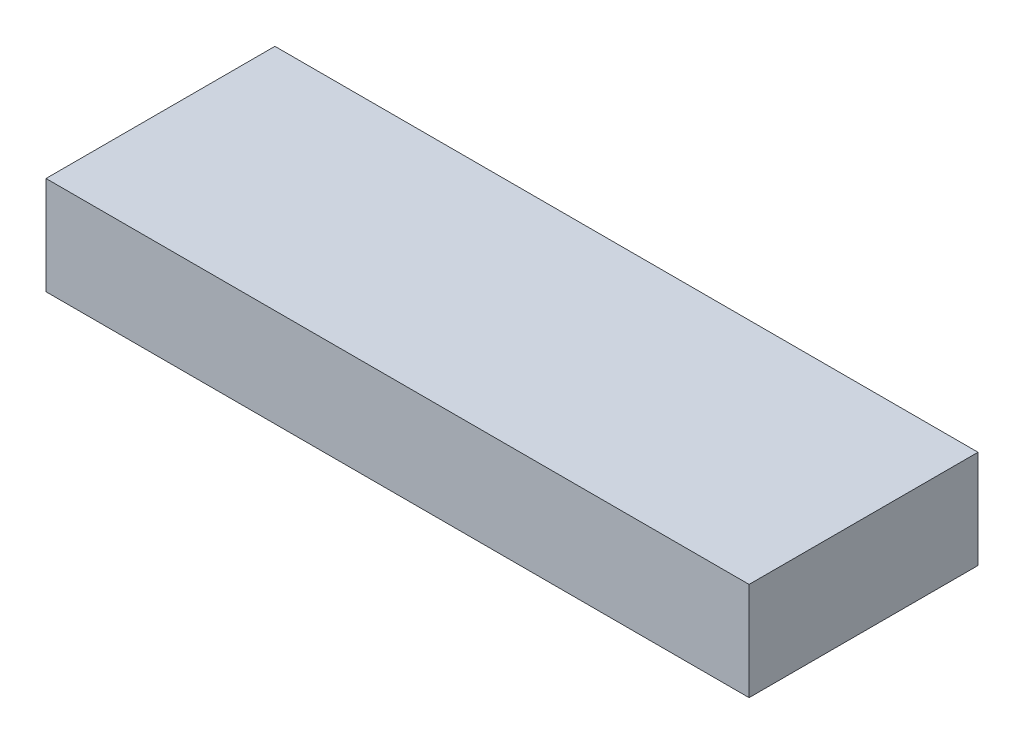
ISO-10303-21;
HEADER;
FILE_DESCRIPTION(('STEP AP214'),'2;1');
FILE_NAME('part.step','',(''),(''),'','','');
FILE_SCHEMA(('AUTOMOTIVE_DESIGN { 1 0 10303 214 1 1 1 1 }'));
ENDSEC;
DATA;
#1=APPLICATION_CONTEXT('core data for automotive mechanical design processes');
#2=APPLICATION_PROTOCOL_DEFINITION('international standard','automotive_design',2000,#1);
#3=PRODUCT_CONTEXT('',#1,'mechanical');
#4=PRODUCT('Part','Part','',(#3));
#5=PRODUCT_RELATED_PRODUCT_CATEGORY('part','',(#4));
#6=PRODUCT_DEFINITION_FORMATION('','',#4);
#7=PRODUCT_DEFINITION_CONTEXT('part definition',#1,'design');
#8=PRODUCT_DEFINITION('design','',#6,#7);
#9=PRODUCT_DEFINITION_SHAPE('','',#8);
#10=(LENGTH_UNIT() NAMED_UNIT(*) SI_UNIT(.MILLI.,.METRE.));
#11=(NAMED_UNIT(*) PLANE_ANGLE_UNIT() SI_UNIT($,.RADIAN.));
#12=(NAMED_UNIT(*) SI_UNIT($,.STERADIAN.) SOLID_ANGLE_UNIT());
#13=UNCERTAINTY_MEASURE_WITH_UNIT(LENGTH_MEASURE(1.E-05),#10,'distance_accuracy_value','');
#14=(GEOMETRIC_REPRESENTATION_CONTEXT(3) GLOBAL_UNCERTAINTY_ASSIGNED_CONTEXT((#13)) GLOBAL_UNIT_ASSIGNED_CONTEXT((#10,
#11,#12)) REPRESENTATION_CONTEXT('',''));
#15=CARTESIAN_POINT('',(0.,0.,0.));
#16=DIRECTION('',(0.,0.,1.));
#17=DIRECTION('',(1.,0.,0.));
#18=AXIS2_PLACEMENT_3D('',#15,#16,#17);
#19=CARTESIAN_POINT('',(0.,38.1,0.));
#20=DIRECTION('',(1.,0.,0.));
#21=DIRECTION('',(0.,0.,-1.));
#22=AXIS2_PLACEMENT_3D('',#19,#20,#21);
#23=PLANE('',#22);
#24=DIRECTION('',(0.,0.,1.));
#25=VECTOR('',#24,1.);
#26=CARTESIAN_POINT('',(0.,0.,0.));
#27=LINE('',#26,#25);
#28=CARTESIAN_POINT('',(0.,0.,0.));
#29=VERTEX_POINT('',#28);
#30=CARTESIAN_POINT('',(0.,0.,88.9));
#31=VERTEX_POINT('',#30);
#32=EDGE_CURVE('E96',#29,#31,#27,.T.);
#33=ORIENTED_EDGE('',*,*,#32,.T.);
#34=DIRECTION('',(0.,-1.,0.));
#35=VECTOR('',#34,1.);
#36=CARTESIAN_POINT('',(0.,38.1,88.9));
#37=LINE('',#36,#35);
#38=CARTESIAN_POINT('',(0.,38.1,88.9));
#39=VERTEX_POINT('',#38);
#40=EDGE_CURVE('E11',#39,#31,#37,.T.);
#41=ORIENTED_EDGE('',*,*,#40,.F.);
#42=DIRECTION('',(0.,0.,1.));
#43=VECTOR('',#42,1.);
#44=CARTESIAN_POINT('',(0.,38.1,0.));
#45=LINE('',#44,#43);
#46=CARTESIAN_POINT('',(0.,38.1,0.));
#47=VERTEX_POINT('',#46);
#48=EDGE_CURVE('E84',#47,#39,#45,.T.);
#49=ORIENTED_EDGE('',*,*,#48,.F.);
#50=DIRECTION('',(0.,-1.,0.));
#51=VECTOR('',#50,1.);
#52=CARTESIAN_POINT('',(0.,38.1,0.));
#53=LINE('',#52,#51);
#54=EDGE_CURVE('E92',#47,#29,#53,.T.);
#55=ORIENTED_EDGE('',*,*,#54,.T.);
#56=EDGE_LOOP('',(#33,#41,#49,#55));
#57=FACE_BOUND('',#56,.T.);
#58=ADVANCED_FACE('F33',(#57),#23,.F.);
#59=CARTESIAN_POINT('',(0.,38.1,88.9));
#60=DIRECTION('',(0.,0.,-1.));
#61=DIRECTION('',(-1.,0.,0.));
#62=AXIS2_PLACEMENT_3D('',#59,#60,#61);
#63=PLANE('',#62);
#64=DIRECTION('',(1.,0.,0.));
#65=VECTOR('',#64,1.);
#66=CARTESIAN_POINT('',(0.,0.,88.9));
#67=LINE('',#66,#65);
#68=CARTESIAN_POINT('',(273.05,0.,88.9));
#69=VERTEX_POINT('',#68);
#70=EDGE_CURVE('E88',#31,#69,#67,.T.);
#71=ORIENTED_EDGE('',*,*,#70,.T.);
#72=DIRECTION('',(0.,-1.,0.));
#73=VECTOR('',#72,1.);
#74=CARTESIAN_POINT('',(273.05,38.1,88.9));
#75=LINE('',#74,#73);
#76=CARTESIAN_POINT('',(273.05,38.1,88.9));
#77=VERTEX_POINT('',#76);
#78=EDGE_CURVE('E41',#77,#69,#75,.T.);
#79=ORIENTED_EDGE('',*,*,#78,.F.);
#80=DIRECTION('',(1.,0.,0.));
#81=VECTOR('',#80,1.);
#82=CARTESIAN_POINT('',(0.,38.1,88.9));
#83=LINE('',#82,#81);
#84=EDGE_CURVE('E79',#39,#77,#83,.T.);
#85=ORIENTED_EDGE('',*,*,#84,.F.);
#86=ORIENTED_EDGE('',*,*,#40,.T.);
#87=EDGE_LOOP('',(#71,#79,#85,#86));
#88=FACE_BOUND('',#87,.T.);
#89=ADVANCED_FACE('F87',(#88),#63,.F.);
#90=CARTESIAN_POINT('',(273.05,38.1,0.));
#91=DIRECTION('',(-1.,0.,0.));
#92=DIRECTION('',(0.,0.,1.));
#93=AXIS2_PLACEMENT_3D('',#90,#91,#92);
#94=PLANE('',#93);
#95=DIRECTION('',(0.,0.,-1.));
#96=VECTOR('',#95,1.);
#97=CARTESIAN_POINT('',(273.05,0.,0.));
#98=LINE('',#97,#96);
#99=CARTESIAN_POINT('',(273.05,0.,0.));
#100=VERTEX_POINT('',#99);
#101=EDGE_CURVE('E66',#69,#100,#98,.T.);
#102=ORIENTED_EDGE('',*,*,#101,.T.);
#103=DIRECTION('',(0.,-1.,0.));
#104=VECTOR('',#103,1.);
#105=CARTESIAN_POINT('',(273.05,38.1,0.));
#106=LINE('',#105,#104);
#107=CARTESIAN_POINT('',(273.05,38.1,0.));
#108=VERTEX_POINT('',#107);
#109=EDGE_CURVE('E89',#108,#100,#106,.T.);
#110=ORIENTED_EDGE('',*,*,#109,.F.);
#111=DIRECTION('',(0.,0.,-1.));
#112=VECTOR('',#111,1.);
#113=CARTESIAN_POINT('',(273.05,38.1,0.));
#114=LINE('',#113,#112);
#115=EDGE_CURVE('E82',#77,#108,#114,.T.);
#116=ORIENTED_EDGE('',*,*,#115,.F.);
#117=ORIENTED_EDGE('',*,*,#78,.T.);
#118=EDGE_LOOP('',(#102,#110,#116,#117));
#119=FACE_BOUND('',#118,.T.);
#120=ADVANCED_FACE('F90',(#119),#94,.F.);
#121=CARTESIAN_POINT('',(0.,38.1,0.));
#122=DIRECTION('',(0.,0.,1.));
#123=DIRECTION('',(1.,0.,0.));
#124=AXIS2_PLACEMENT_3D('',#121,#122,#123);
#125=PLANE('',#124);
#126=DIRECTION('',(-1.,0.,0.));
#127=VECTOR('',#126,1.);
#128=CARTESIAN_POINT('',(0.,0.,0.));
#129=LINE('',#128,#127);
#130=EDGE_CURVE('E72',#100,#29,#129,.T.);
#131=ORIENTED_EDGE('',*,*,#130,.T.);
#132=ORIENTED_EDGE('',*,*,#54,.F.);
#133=DIRECTION('',(-1.,0.,0.));
#134=VECTOR('',#133,1.);
#135=CARTESIAN_POINT('',(0.,38.1,0.));
#136=LINE('',#135,#134);
#137=EDGE_CURVE('E49',#108,#47,#136,.T.);
#138=ORIENTED_EDGE('',*,*,#137,.F.);
#139=ORIENTED_EDGE('',*,*,#109,.T.);
#140=EDGE_LOOP('',(#131,#132,#138,#139));
#141=FACE_BOUND('',#140,.T.);
#142=ADVANCED_FACE('F103',(#141),#125,.F.);
#143=CARTESIAN_POINT('',(0.,38.1,0.));
#144=DIRECTION('',(0.,1.,0.));
#145=DIRECTION('',(0.,0.,1.));
#146=AXIS2_PLACEMENT_3D('',#143,#144,#145);
#147=PLANE('',#146);
#148=ORIENTED_EDGE('',*,*,#48,.T.);
#149=ORIENTED_EDGE('',*,*,#84,.T.);
#150=ORIENTED_EDGE('',*,*,#115,.T.);
#151=ORIENTED_EDGE('',*,*,#137,.T.);
#152=EDGE_LOOP('',(#148,#149,#150,#151));
#153=FACE_BOUND('',#152,.T.);
#154=ADVANCED_FACE('F80',(#153),#147,.T.);
#155=CARTESIAN_POINT('',(0.,0.,0.));
#156=DIRECTION('',(0.,1.,0.));
#157=DIRECTION('',(0.,0.,1.));
#158=AXIS2_PLACEMENT_3D('',#155,#156,#157);
#159=PLANE('',#158);
#160=ORIENTED_EDGE('',*,*,#32,.F.);
#161=ORIENTED_EDGE('',*,*,#130,.F.);
#162=ORIENTED_EDGE('',*,*,#101,.F.);
#163=ORIENTED_EDGE('',*,*,#70,.F.);
#164=EDGE_LOOP('',(#160,#161,#162,#163));
#165=FACE_BOUND('',#164,.T.);
#166=ADVANCED_FACE('F106',(#165),#159,.F.);
#167=CLOSED_SHELL('',(#58,#89,#120,#142,#154,#166));
#168=MANIFOLD_SOLID_BREP('B2',#167);
#169=ADVANCED_BREP_SHAPE_REPRESENTATION('',(#18,#168),#14);
#170=SHAPE_DEFINITION_REPRESENTATION(#9,#169);
ENDSEC;
END-ISO-10303-21;
